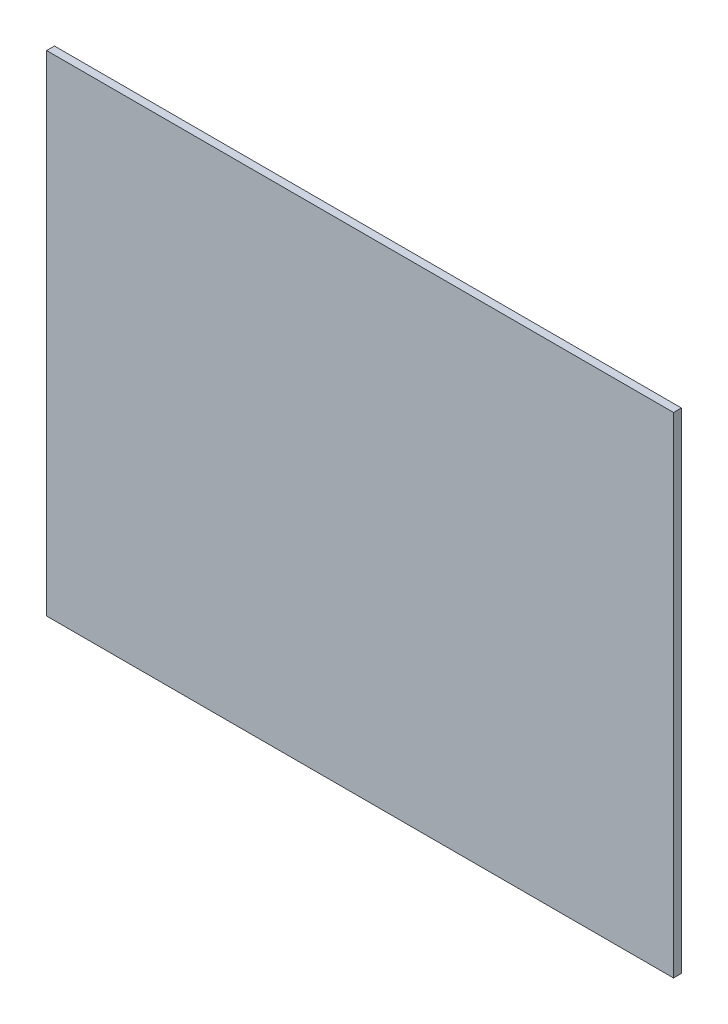
ISO-10303-21;
HEADER;
FILE_DESCRIPTION(('STEP AP214'),'2;1');
FILE_NAME('part.step','',(''),(''),'','','');
FILE_SCHEMA(('AUTOMOTIVE_DESIGN { 1 0 10303 214 1 1 1 1 }'));
ENDSEC;
DATA;
#1=APPLICATION_CONTEXT('core data for automotive mechanical design processes');
#2=APPLICATION_PROTOCOL_DEFINITION('international standard','automotive_design',2000,#1);
#3=PRODUCT_CONTEXT('',#1,'mechanical');
#4=PRODUCT('Part','Part','',(#3));
#5=PRODUCT_RELATED_PRODUCT_CATEGORY('part','',(#4));
#6=PRODUCT_DEFINITION_FORMATION('','',#4);
#7=PRODUCT_DEFINITION_CONTEXT('part definition',#1,'design');
#8=PRODUCT_DEFINITION('design','',#6,#7);
#9=PRODUCT_DEFINITION_SHAPE('','',#8);
#10=(LENGTH_UNIT() NAMED_UNIT(*) SI_UNIT(.MILLI.,.METRE.));
#11=(NAMED_UNIT(*) PLANE_ANGLE_UNIT() SI_UNIT($,.RADIAN.));
#12=(NAMED_UNIT(*) SI_UNIT($,.STERADIAN.) SOLID_ANGLE_UNIT());
#13=UNCERTAINTY_MEASURE_WITH_UNIT(LENGTH_MEASURE(1.E-05),#10,'distance_accuracy_value','');
#14=(GEOMETRIC_REPRESENTATION_CONTEXT(3) GLOBAL_UNCERTAINTY_ASSIGNED_CONTEXT((#13)) GLOBAL_UNIT_ASSIGNED_CONTEXT((#10,
#11,#12)) REPRESENTATION_CONTEXT('',''));
#15=CARTESIAN_POINT('',(0.,0.,0.));
#16=DIRECTION('',(0.,0.,1.));
#17=DIRECTION('',(1.,0.,0.));
#18=AXIS2_PLACEMENT_3D('',#15,#16,#17);
#19=CARTESIAN_POINT('',(52.3676356718231,-148.027068540586,2.));
#20=DIRECTION('',(-1.,0.,0.));
#21=DIRECTION('',(0.,-1.,0.));
#22=AXIS2_PLACEMENT_3D('',#19,#20,#21);
#23=PLANE('',#22);
#24=DIRECTION('',(0.,1.,0.));
#25=VECTOR('',#24,1.);
#26=CARTESIAN_POINT('',(52.3676356718231,-148.027068540586,0.));
#27=LINE('',#26,#25);
#28=CARTESIAN_POINT('',(52.3676356718231,-148.027068540586,0.));
#29=VERTEX_POINT('',#28);
#30=CARTESIAN_POINT('',(52.3676356718231,-23.0270685405863,0.));
#31=VERTEX_POINT('',#30);
#32=EDGE_CURVE('E96',#29,#31,#27,.T.);
#33=ORIENTED_EDGE('',*,*,#32,.T.);
#34=DIRECTION('',(0.,0.,-1.));
#35=VECTOR('',#34,1.);
#36=CARTESIAN_POINT('',(52.3676356718231,-23.0270685405863,2.));
#37=LINE('',#36,#35);
#38=CARTESIAN_POINT('',(52.3676356718231,-23.0270685405863,2.));
#39=VERTEX_POINT('',#38);
#40=EDGE_CURVE('E11',#39,#31,#37,.T.);
#41=ORIENTED_EDGE('',*,*,#40,.F.);
#42=DIRECTION('',(0.,1.,0.));
#43=VECTOR('',#42,1.);
#44=CARTESIAN_POINT('',(52.3676356718231,-148.027068540586,2.));
#45=LINE('',#44,#43);
#46=CARTESIAN_POINT('',(52.3676356718231,-148.027068540586,2.));
#47=VERTEX_POINT('',#46);
#48=EDGE_CURVE('E84',#47,#39,#45,.T.);
#49=ORIENTED_EDGE('',*,*,#48,.F.);
#50=DIRECTION('',(0.,0.,-1.));
#51=VECTOR('',#50,1.);
#52=CARTESIAN_POINT('',(52.3676356718231,-148.027068540586,2.));
#53=LINE('',#52,#51);
#54=EDGE_CURVE('E92',#47,#29,#53,.T.);
#55=ORIENTED_EDGE('',*,*,#54,.T.);
#56=EDGE_LOOP('',(#33,#41,#49,#55));
#57=FACE_BOUND('',#56,.T.);
#58=ADVANCED_FACE('F33',(#57),#23,.F.);
#59=CARTESIAN_POINT('',(52.3676356718231,-23.0270685405863,2.));
#60=DIRECTION('',(0.,-1.,0.));
#61=DIRECTION('',(1.,0.,0.));
#62=AXIS2_PLACEMENT_3D('',#59,#60,#61);
#63=PLANE('',#62);
#64=DIRECTION('',(-1.,0.,0.));
#65=VECTOR('',#64,1.);
#66=CARTESIAN_POINT('',(52.3676356718231,-23.0270685405863,0.));
#67=LINE('',#66,#65);
#68=CARTESIAN_POINT('',(-107.632364328177,-23.0270685405863,0.));
#69=VERTEX_POINT('',#68);
#70=EDGE_CURVE('E88',#31,#69,#67,.T.);
#71=ORIENTED_EDGE('',*,*,#70,.T.);
#72=DIRECTION('',(0.,0.,-1.));
#73=VECTOR('',#72,1.);
#74=CARTESIAN_POINT('',(-107.632364328177,-23.0270685405863,2.));
#75=LINE('',#74,#73);
#76=CARTESIAN_POINT('',(-107.632364328177,-23.0270685405863,2.));
#77=VERTEX_POINT('',#76);
#78=EDGE_CURVE('E41',#77,#69,#75,.T.);
#79=ORIENTED_EDGE('',*,*,#78,.F.);
#80=DIRECTION('',(-1.,0.,0.));
#81=VECTOR('',#80,1.);
#82=CARTESIAN_POINT('',(52.3676356718231,-23.0270685405863,2.));
#83=LINE('',#82,#81);
#84=EDGE_CURVE('E79',#39,#77,#83,.T.);
#85=ORIENTED_EDGE('',*,*,#84,.F.);
#86=ORIENTED_EDGE('',*,*,#40,.T.);
#87=EDGE_LOOP('',(#71,#79,#85,#86));
#88=FACE_BOUND('',#87,.T.);
#89=ADVANCED_FACE('F87',(#88),#63,.F.);
#90=CARTESIAN_POINT('',(-107.632364328177,-148.027068540586,2.));
#91=DIRECTION('',(1.,0.,0.));
#92=DIRECTION('',(0.,0.,-1.));
#93=AXIS2_PLACEMENT_3D('',#90,#91,#92);
#94=PLANE('',#93);
#95=DIRECTION('',(0.,-1.,0.));
#96=VECTOR('',#95,1.);
#97=CARTESIAN_POINT('',(-107.632364328177,-148.027068540586,0.));
#98=LINE('',#97,#96);
#99=CARTESIAN_POINT('',(-107.632364328177,-148.027068540586,0.));
#100=VERTEX_POINT('',#99);
#101=EDGE_CURVE('E66',#69,#100,#98,.T.);
#102=ORIENTED_EDGE('',*,*,#101,.T.);
#103=DIRECTION('',(0.,0.,-1.));
#104=VECTOR('',#103,1.);
#105=CARTESIAN_POINT('',(-107.632364328177,-148.027068540586,2.));
#106=LINE('',#105,#104);
#107=CARTESIAN_POINT('',(-107.632364328177,-148.027068540586,2.));
#108=VERTEX_POINT('',#107);
#109=EDGE_CURVE('E89',#108,#100,#106,.T.);
#110=ORIENTED_EDGE('',*,*,#109,.F.);
#111=DIRECTION('',(0.,-1.,0.));
#112=VECTOR('',#111,1.);
#113=CARTESIAN_POINT('',(-107.632364328177,-148.027068540586,2.));
#114=LINE('',#113,#112);
#115=EDGE_CURVE('E82',#77,#108,#114,.T.);
#116=ORIENTED_EDGE('',*,*,#115,.F.);
#117=ORIENTED_EDGE('',*,*,#78,.T.);
#118=EDGE_LOOP('',(#102,#110,#116,#117));
#119=FACE_BOUND('',#118,.T.);
#120=ADVANCED_FACE('F90',(#119),#94,.F.);
#121=CARTESIAN_POINT('',(52.3676356718231,-148.027068540586,2.));
#122=DIRECTION('',(0.,1.,0.));
#123=DIRECTION('',(0.,0.,1.));
#124=AXIS2_PLACEMENT_3D('',#121,#122,#123);
#125=PLANE('',#124);
#126=DIRECTION('',(1.,0.,0.));
#127=VECTOR('',#126,1.);
#128=CARTESIAN_POINT('',(52.3676356718231,-148.027068540586,0.));
#129=LINE('',#128,#127);
#130=EDGE_CURVE('E72',#100,#29,#129,.T.);
#131=ORIENTED_EDGE('',*,*,#130,.T.);
#132=ORIENTED_EDGE('',*,*,#54,.F.);
#133=DIRECTION('',(1.,0.,0.));
#134=VECTOR('',#133,1.);
#135=CARTESIAN_POINT('',(52.3676356718231,-148.027068540586,2.));
#136=LINE('',#135,#134);
#137=EDGE_CURVE('E49',#108,#47,#136,.T.);
#138=ORIENTED_EDGE('',*,*,#137,.F.);
#139=ORIENTED_EDGE('',*,*,#109,.T.);
#140=EDGE_LOOP('',(#131,#132,#138,#139));
#141=FACE_BOUND('',#140,.T.);
#142=ADVANCED_FACE('F103',(#141),#125,.F.);
#143=CARTESIAN_POINT('',(0.,0.,2.));
#144=DIRECTION('',(0.,0.,1.));
#145=DIRECTION('',(1.,0.,0.));
#146=AXIS2_PLACEMENT_3D('',#143,#144,#145);
#147=PLANE('',#146);
#148=ORIENTED_EDGE('',*,*,#48,.T.);
#149=ORIENTED_EDGE('',*,*,#84,.T.);
#150=ORIENTED_EDGE('',*,*,#115,.T.);
#151=ORIENTED_EDGE('',*,*,#137,.T.);
#152=EDGE_LOOP('',(#148,#149,#150,#151));
#153=FACE_BOUND('',#152,.T.);
#154=ADVANCED_FACE('F80',(#153),#147,.T.);
#155=CARTESIAN_POINT('',(0.,0.,0.));
#156=DIRECTION('',(0.,0.,1.));
#157=DIRECTION('',(1.,0.,0.));
#158=AXIS2_PLACEMENT_3D('',#155,#156,#157);
#159=PLANE('',#158);
#160=ORIENTED_EDGE('',*,*,#32,.F.);
#161=ORIENTED_EDGE('',*,*,#130,.F.);
#162=ORIENTED_EDGE('',*,*,#101,.F.);
#163=ORIENTED_EDGE('',*,*,#70,.F.);
#164=EDGE_LOOP('',(#160,#161,#162,#163));
#165=FACE_BOUND('',#164,.T.);
#166=ADVANCED_FACE('F106',(#165),#159,.F.);
#167=CLOSED_SHELL('',(#58,#89,#120,#142,#154,#166));
#168=MANIFOLD_SOLID_BREP('B2',#167);
#169=ADVANCED_BREP_SHAPE_REPRESENTATION('',(#18,#168),#14);
#170=SHAPE_DEFINITION_REPRESENTATION(#9,#169);
ENDSEC;
END-ISO-10303-21;
